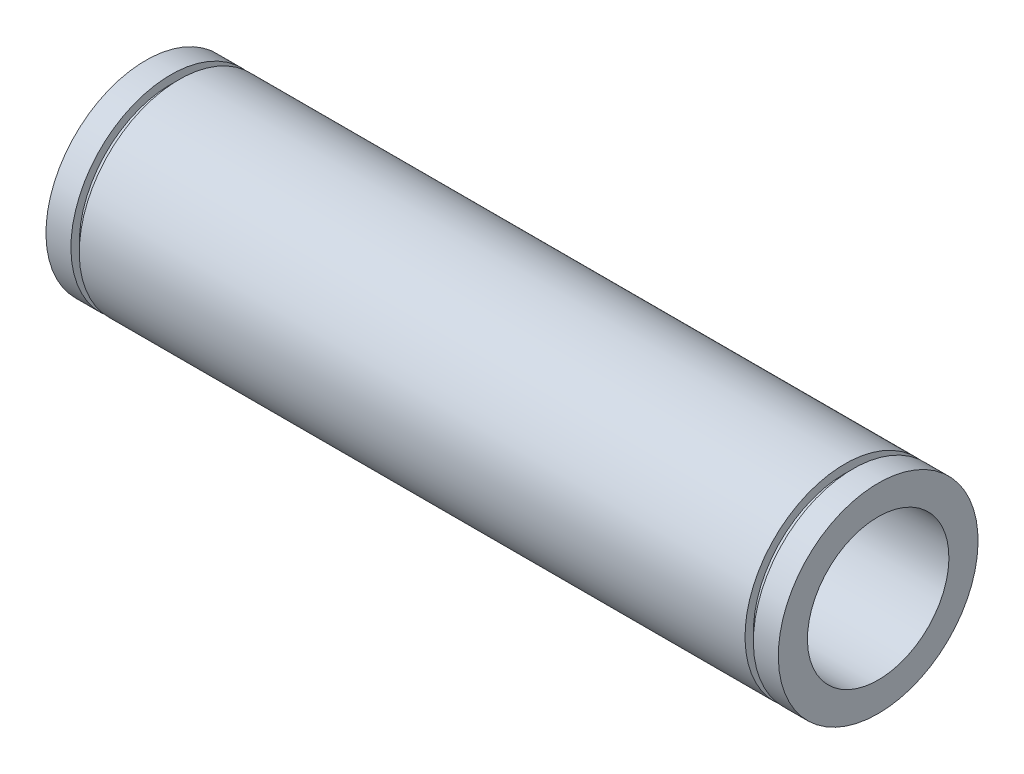
ISO-10303-21;
HEADER;
FILE_DESCRIPTION(('STEP AP214'),'2;1');
FILE_NAME('part.step','',(''),(''),'','','');
FILE_SCHEMA(('AUTOMOTIVE_DESIGN { 1 0 10303 214 1 1 1 1 }'));
ENDSEC;
DATA;
#1=APPLICATION_CONTEXT('core data for automotive mechanical design processes');
#2=APPLICATION_PROTOCOL_DEFINITION('international standard','automotive_design',2000,#1);
#3=PRODUCT_CONTEXT('',#1,'mechanical');
#4=PRODUCT('Part','Part','',(#3));
#5=PRODUCT_RELATED_PRODUCT_CATEGORY('part','',(#4));
#6=PRODUCT_DEFINITION_FORMATION('','',#4);
#7=PRODUCT_DEFINITION_CONTEXT('part definition',#1,'design');
#8=PRODUCT_DEFINITION('design','',#6,#7);
#9=PRODUCT_DEFINITION_SHAPE('','',#8);
#10=(LENGTH_UNIT() NAMED_UNIT(*) SI_UNIT(.MILLI.,.METRE.));
#11=(NAMED_UNIT(*) PLANE_ANGLE_UNIT() SI_UNIT($,.RADIAN.));
#12=(NAMED_UNIT(*) SI_UNIT($,.STERADIAN.) SOLID_ANGLE_UNIT());
#13=UNCERTAINTY_MEASURE_WITH_UNIT(LENGTH_MEASURE(1.E-05),#10,'distance_accuracy_value','');
#14=(GEOMETRIC_REPRESENTATION_CONTEXT(3) GLOBAL_UNCERTAINTY_ASSIGNED_CONTEXT((#13)) GLOBAL_UNIT_ASSIGNED_CONTEXT((#10,
#11,#12)) REPRESENTATION_CONTEXT('',''));
#15=CARTESIAN_POINT('',(0.,0.,0.));
#16=DIRECTION('',(0.,0.,1.));
#17=DIRECTION('',(1.,0.,0.));
#18=AXIS2_PLACEMENT_3D('',#15,#16,#17);
#19=CARTESIAN_POINT('',(-44.,0.,0.));
#20=DIRECTION('',(1.,0.,0.));
#21=DIRECTION('',(0.,1.,0.));
#22=AXIS2_PLACEMENT_3D('',#19,#20,#21);
#23=PLANE('',#22);
#24=CARTESIAN_POINT('',(-44.,0.,0.));
#25=DIRECTION('',(1.,0.,0.));
#26=DIRECTION('',(0.,1.,0.));
#27=AXIS2_PLACEMENT_3D('',#24,#25,#26);
#28=CIRCLE('',#27,8.5);
#29=CARTESIAN_POINT('',(-44.,8.49999999999999,0.));
#30=VERTEX_POINT('',#29);
#31=EDGE_CURVE('E88',#30,#30,#28,.T.);
#32=ORIENTED_EDGE('',*,*,#31,.T.);
#33=EDGE_LOOP('',(#32));
#34=FACE_BOUND('',#33,.T.);
#35=CARTESIAN_POINT('',(-44.,0.,0.));
#36=DIRECTION('',(-1.,0.,0.));
#37=DIRECTION('',(0.,-1.,0.));
#38=AXIS2_PLACEMENT_3D('',#35,#36,#37);
#39=CIRCLE('',#38,12.);
#40=CARTESIAN_POINT('',(-44.,-12.,0.));
#41=VERTEX_POINT('',#40);
#42=EDGE_CURVE('E10',#41,#41,#39,.T.);
#43=ORIENTED_EDGE('',*,*,#42,.T.);
#44=EDGE_LOOP('',(#43));
#45=FACE_BOUND('',#44,.T.);
#46=ADVANCED_FACE('F41',(#34,#45),#23,.F.);
#47=CARTESIAN_POINT('',(-44.,0.,0.));
#48=DIRECTION('',(-1.,0.,0.));
#49=DIRECTION('',(0.,-1.,0.));
#50=AXIS2_PLACEMENT_3D('',#47,#48,#49);
#51=CYLINDRICAL_SURFACE('',#50,12.);
#52=ORIENTED_EDGE('',*,*,#42,.F.);
#53=EDGE_LOOP('',(#52));
#54=FACE_BOUND('',#53,.T.);
#55=CARTESIAN_POINT('',(-41.,0.,0.));
#56=DIRECTION('',(-1.,0.,0.));
#57=DIRECTION('',(0.,-1.,0.));
#58=AXIS2_PLACEMENT_3D('',#55,#56,#57);
#59=CIRCLE('',#58,12.);
#60=CARTESIAN_POINT('',(-41.,-12.,0.));
#61=VERTEX_POINT('',#60);
#62=EDGE_CURVE('E48',#61,#61,#59,.T.);
#63=ORIENTED_EDGE('',*,*,#62,.T.);
#64=EDGE_LOOP('',(#63));
#65=FACE_BOUND('',#64,.T.);
#66=ADVANCED_FACE('F123',(#54,#65),#51,.T.);
#67=CARTESIAN_POINT('',(-41.,12.,0.));
#68=DIRECTION('',(-1.,0.,0.));
#69=DIRECTION('',(0.,-1.,0.));
#70=AXIS2_PLACEMENT_3D('',#67,#68,#69);
#71=PLANE('',#70);
#72=ORIENTED_EDGE('',*,*,#62,.F.);
#73=EDGE_LOOP('',(#72));
#74=FACE_BOUND('',#73,.T.);
#75=CARTESIAN_POINT('',(-41.,0.,0.));
#76=DIRECTION('',(-1.,0.,0.));
#77=DIRECTION('',(0.,-1.,0.));
#78=AXIS2_PLACEMENT_3D('',#75,#76,#77);
#79=CIRCLE('',#78,11.);
#80=CARTESIAN_POINT('',(-41.,-11.,0.));
#81=VERTEX_POINT('',#80);
#82=EDGE_CURVE('E53',#81,#81,#79,.T.);
#83=ORIENTED_EDGE('',*,*,#82,.T.);
#84=EDGE_LOOP('',(#83));
#85=FACE_BOUND('',#84,.T.);
#86=ADVANCED_FACE('F127',(#74,#85),#71,.F.);
#87=CARTESIAN_POINT('',(-44.,0.,0.));
#88=DIRECTION('',(-1.,0.,0.));
#89=DIRECTION('',(0.,-1.,0.));
#90=AXIS2_PLACEMENT_3D('',#87,#88,#89);
#91=CYLINDRICAL_SURFACE('',#90,11.);
#92=ORIENTED_EDGE('',*,*,#82,.F.);
#93=EDGE_LOOP('',(#92));
#94=FACE_BOUND('',#93,.T.);
#95=CARTESIAN_POINT('',(-40.,0.,0.));
#96=DIRECTION('',(-1.,0.,0.));
#97=DIRECTION('',(0.,-1.,0.));
#98=AXIS2_PLACEMENT_3D('',#95,#96,#97);
#99=CIRCLE('',#98,11.);
#100=CARTESIAN_POINT('',(-40.,-11.,0.));
#101=VERTEX_POINT('',#100);
#102=EDGE_CURVE('E58',#101,#101,#99,.T.);
#103=ORIENTED_EDGE('',*,*,#102,.T.);
#104=EDGE_LOOP('',(#103));
#105=FACE_BOUND('',#104,.T.);
#106=ADVANCED_FACE('F132',(#94,#105),#91,.T.);
#107=CARTESIAN_POINT('',(-40.,11.,0.));
#108=DIRECTION('',(1.,0.,0.));
#109=DIRECTION('',(0.,1.,0.));
#110=AXIS2_PLACEMENT_3D('',#107,#108,#109);
#111=PLANE('',#110);
#112=ORIENTED_EDGE('',*,*,#102,.F.);
#113=EDGE_LOOP('',(#112));
#114=FACE_BOUND('',#113,.T.);
#115=CARTESIAN_POINT('',(-40.,0.,0.));
#116=DIRECTION('',(-1.,0.,0.));
#117=DIRECTION('',(0.,-1.,0.));
#118=AXIS2_PLACEMENT_3D('',#115,#116,#117);
#119=CIRCLE('',#118,12.);
#120=CARTESIAN_POINT('',(-40.,-12.,0.));
#121=VERTEX_POINT('',#120);
#122=EDGE_CURVE('E64',#121,#121,#119,.T.);
#123=ORIENTED_EDGE('',*,*,#122,.T.);
#124=EDGE_LOOP('',(#123));
#125=FACE_BOUND('',#124,.T.);
#126=ADVANCED_FACE('F138',(#114,#125),#111,.F.);
#127=CARTESIAN_POINT('',(-44.,0.,0.));
#128=DIRECTION('',(-1.,0.,0.));
#129=DIRECTION('',(0.,-1.,0.));
#130=AXIS2_PLACEMENT_3D('',#127,#128,#129);
#131=CYLINDRICAL_SURFACE('',#130,12.);
#132=ORIENTED_EDGE('',*,*,#122,.F.);
#133=EDGE_LOOP('',(#132));
#134=FACE_BOUND('',#133,.T.);
#135=CARTESIAN_POINT('',(40.,0.,0.));
#136=DIRECTION('',(-1.,0.,0.));
#137=DIRECTION('',(0.,-1.,0.));
#138=AXIS2_PLACEMENT_3D('',#135,#136,#137);
#139=CIRCLE('',#138,12.);
#140=CARTESIAN_POINT('',(40.,-12.,0.));
#141=VERTEX_POINT('',#140);
#142=EDGE_CURVE('E68',#141,#141,#139,.T.);
#143=ORIENTED_EDGE('',*,*,#142,.T.);
#144=EDGE_LOOP('',(#143));
#145=FACE_BOUND('',#144,.T.);
#146=ADVANCED_FACE('F142',(#134,#145),#131,.T.);
#147=CARTESIAN_POINT('',(40.,11.,0.));
#148=DIRECTION('',(-1.,0.,0.));
#149=DIRECTION('',(0.,-1.,0.));
#150=AXIS2_PLACEMENT_3D('',#147,#148,#149);
#151=PLANE('',#150);
#152=ORIENTED_EDGE('',*,*,#142,.F.);
#153=EDGE_LOOP('',(#152));
#154=FACE_BOUND('',#153,.T.);
#155=CARTESIAN_POINT('',(40.,0.,0.));
#156=DIRECTION('',(-1.,0.,0.));
#157=DIRECTION('',(0.,-1.,0.));
#158=AXIS2_PLACEMENT_3D('',#155,#156,#157);
#159=CIRCLE('',#158,11.);
#160=CARTESIAN_POINT('',(40.,-11.,0.));
#161=VERTEX_POINT('',#160);
#162=EDGE_CURVE('E72',#161,#161,#159,.T.);
#163=ORIENTED_EDGE('',*,*,#162,.T.);
#164=EDGE_LOOP('',(#163));
#165=FACE_BOUND('',#164,.T.);
#166=ADVANCED_FACE('F146',(#154,#165),#151,.F.);
#167=CARTESIAN_POINT('',(-44.,0.,0.));
#168=DIRECTION('',(-1.,0.,0.));
#169=DIRECTION('',(0.,-1.,0.));
#170=AXIS2_PLACEMENT_3D('',#167,#168,#169);
#171=CYLINDRICAL_SURFACE('',#170,11.);
#172=ORIENTED_EDGE('',*,*,#162,.F.);
#173=EDGE_LOOP('',(#172));
#174=FACE_BOUND('',#173,.T.);
#175=CARTESIAN_POINT('',(41.,0.,0.));
#176=DIRECTION('',(-1.,0.,0.));
#177=DIRECTION('',(0.,-1.,0.));
#178=AXIS2_PLACEMENT_3D('',#175,#176,#177);
#179=CIRCLE('',#178,11.);
#180=CARTESIAN_POINT('',(41.,-11.,0.));
#181=VERTEX_POINT('',#180);
#182=EDGE_CURVE('E76',#181,#181,#179,.T.);
#183=ORIENTED_EDGE('',*,*,#182,.T.);
#184=EDGE_LOOP('',(#183));
#185=FACE_BOUND('',#184,.T.);
#186=ADVANCED_FACE('F118',(#174,#185),#171,.T.);
#187=CARTESIAN_POINT('',(41.,12.,0.));
#188=DIRECTION('',(1.,0.,0.));
#189=DIRECTION('',(0.,1.,0.));
#190=AXIS2_PLACEMENT_3D('',#187,#188,#189);
#191=PLANE('',#190);
#192=ORIENTED_EDGE('',*,*,#182,.F.);
#193=EDGE_LOOP('',(#192));
#194=FACE_BOUND('',#193,.T.);
#195=CARTESIAN_POINT('',(41.,0.,0.));
#196=DIRECTION('',(-1.,0.,0.));
#197=DIRECTION('',(0.,-1.,0.));
#198=AXIS2_PLACEMENT_3D('',#195,#196,#197);
#199=CIRCLE('',#198,12.);
#200=CARTESIAN_POINT('',(41.,-12.,0.));
#201=VERTEX_POINT('',#200);
#202=EDGE_CURVE('E80',#201,#201,#199,.T.);
#203=ORIENTED_EDGE('',*,*,#202,.T.);
#204=EDGE_LOOP('',(#203));
#205=FACE_BOUND('',#204,.T.);
#206=ADVANCED_FACE('F112',(#194,#205),#191,.F.);
#207=CARTESIAN_POINT('',(-44.,0.,0.));
#208=DIRECTION('',(-1.,0.,0.));
#209=DIRECTION('',(0.,-1.,0.));
#210=AXIS2_PLACEMENT_3D('',#207,#208,#209);
#211=CYLINDRICAL_SURFACE('',#210,12.);
#212=ORIENTED_EDGE('',*,*,#202,.F.);
#213=EDGE_LOOP('',(#212));
#214=FACE_BOUND('',#213,.T.);
#215=CARTESIAN_POINT('',(44.,0.,0.));
#216=DIRECTION('',(-1.,0.,0.));
#217=DIRECTION('',(0.,-1.,0.));
#218=AXIS2_PLACEMENT_3D('',#215,#216,#217);
#219=CIRCLE('',#218,12.);
#220=CARTESIAN_POINT('',(44.,-12.,0.));
#221=VERTEX_POINT('',#220);
#222=EDGE_CURVE('E84',#221,#221,#219,.T.);
#223=ORIENTED_EDGE('',*,*,#222,.T.);
#224=EDGE_LOOP('',(#223));
#225=FACE_BOUND('',#224,.T.);
#226=ADVANCED_FACE('F107',(#214,#225),#211,.T.);
#227=CARTESIAN_POINT('',(44.,12.,0.));
#228=DIRECTION('',(-1.,0.,0.));
#229=DIRECTION('',(0.,-1.,0.));
#230=AXIS2_PLACEMENT_3D('',#227,#228,#229);
#231=PLANE('',#230);
#232=CARTESIAN_POINT('',(44.,0.,0.));
#233=DIRECTION('',(1.,0.,0.));
#234=DIRECTION('',(0.,1.,0.));
#235=AXIS2_PLACEMENT_3D('',#232,#233,#234);
#236=CIRCLE('',#235,8.5);
#237=CARTESIAN_POINT('',(44.,8.50000000000001,0.));
#238=VERTEX_POINT('',#237);
#239=EDGE_CURVE('E89',#238,#238,#236,.T.);
#240=ORIENTED_EDGE('',*,*,#239,.F.);
#241=EDGE_LOOP('',(#240));
#242=FACE_BOUND('',#241,.T.);
#243=ORIENTED_EDGE('',*,*,#222,.F.);
#244=EDGE_LOOP('',(#243));
#245=FACE_BOUND('',#244,.T.);
#246=ADVANCED_FACE('F101',(#242,#245),#231,.F.);
#247=CARTESIAN_POINT('',(-44.,0.,0.));
#248=DIRECTION('',(1.,0.,0.));
#249=DIRECTION('',(0.,1.,0.));
#250=AXIS2_PLACEMENT_3D('',#247,#248,#249);
#251=CYLINDRICAL_SURFACE('',#250,8.5);
#252=ORIENTED_EDGE('',*,*,#31,.F.);
#253=EDGE_LOOP('',(#252));
#254=FACE_BOUND('',#253,.T.);
#255=ORIENTED_EDGE('',*,*,#239,.T.);
#256=EDGE_LOOP('',(#255));
#257=FACE_BOUND('',#256,.T.);
#258=ADVANCED_FACE('F98',(#254,#257),#251,.F.);
#259=CLOSED_SHELL('',(#46,#66,#86,#106,#126,#146,#166,#186,#206,#226,#246,#258));
#260=MANIFOLD_SOLID_BREP('B2',#259);
#261=ADVANCED_BREP_SHAPE_REPRESENTATION('',(#18,#260),#14);
#262=SHAPE_DEFINITION_REPRESENTATION(#9,#261);
ENDSEC;
END-ISO-10303-21;
